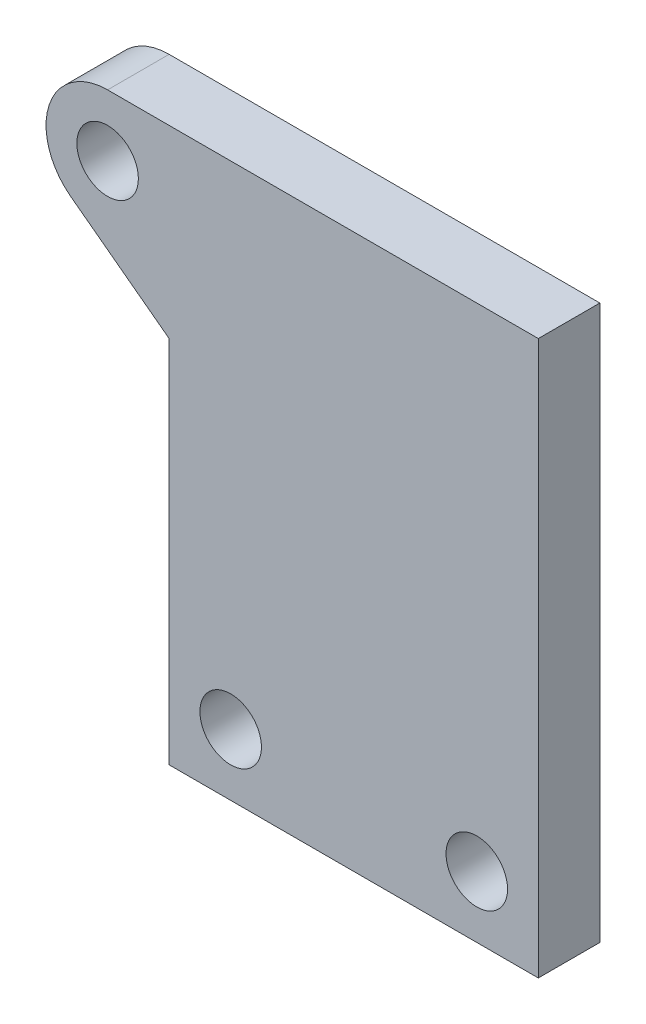
ISO-10303-21;
HEADER;
FILE_DESCRIPTION(('STEP AP214'),'2;1');
FILE_NAME('part.step','',(''),(''),'','','');
FILE_SCHEMA(('AUTOMOTIVE_DESIGN { 1 0 10303 214 1 1 1 1 }'));
ENDSEC;
DATA;
#1=APPLICATION_CONTEXT('core data for automotive mechanical design processes');
#2=APPLICATION_PROTOCOL_DEFINITION('international standard','automotive_design',2000,#1);
#3=PRODUCT_CONTEXT('',#1,'mechanical');
#4=PRODUCT('Part','Part','',(#3));
#5=PRODUCT_RELATED_PRODUCT_CATEGORY('part','',(#4));
#6=PRODUCT_DEFINITION_FORMATION('','',#4);
#7=PRODUCT_DEFINITION_CONTEXT('part definition',#1,'design');
#8=PRODUCT_DEFINITION('design','',#6,#7);
#9=PRODUCT_DEFINITION_SHAPE('','',#8);
#10=(LENGTH_UNIT() NAMED_UNIT(*) SI_UNIT(.MILLI.,.METRE.));
#11=(NAMED_UNIT(*) PLANE_ANGLE_UNIT() SI_UNIT($,.RADIAN.));
#12=(NAMED_UNIT(*) SI_UNIT($,.STERADIAN.) SOLID_ANGLE_UNIT());
#13=UNCERTAINTY_MEASURE_WITH_UNIT(LENGTH_MEASURE(1.E-05),#10,'distance_accuracy_value','');
#14=(GEOMETRIC_REPRESENTATION_CONTEXT(3) GLOBAL_UNCERTAINTY_ASSIGNED_CONTEXT((#13)) GLOBAL_UNIT_ASSIGNED_CONTEXT((#10,
#11,#12)) REPRESENTATION_CONTEXT('',''));
#15=CARTESIAN_POINT('',(0.,0.,0.));
#16=DIRECTION('',(0.,0.,1.));
#17=DIRECTION('',(1.,0.,0.));
#18=AXIS2_PLACEMENT_3D('',#15,#16,#17);
#19=CARTESIAN_POINT('',(-20.,35.,5.));
#20=DIRECTION('',(0.,0.,1.));
#21=DIRECTION('',(1.,0.,0.));
#22=AXIS2_PLACEMENT_3D('',#19,#20,#21);
#23=PLANE('',#22);
#24=CARTESIAN_POINT('',(10.,0.,5.));
#25=DIRECTION('',(0.,0.,1.));
#26=DIRECTION('',(1.,0.,0.));
#27=AXIS2_PLACEMENT_3D('',#24,#25,#26);
#28=CIRCLE('',#27,2.5);
#29=CARTESIAN_POINT('',(12.5,0.,5.));
#30=VERTEX_POINT('',#29);
#31=EDGE_CURVE('E192',#30,#30,#28,.T.);
#32=ORIENTED_EDGE('',*,*,#31,.F.);
#33=EDGE_LOOP('',(#32));
#34=FACE_BOUND('',#33,.T.);
#35=DIRECTION('',(0.,-1.,0.));
#36=VECTOR('',#35,1.);
#37=CARTESIAN_POINT('',(-15.,-5.,5.));
#38=LINE('',#37,#36);
#39=CARTESIAN_POINT('',(-15.,25.,5.));
#40=VERTEX_POINT('',#39);
#41=CARTESIAN_POINT('',(-15.,-5.,5.));
#42=VERTEX_POINT('',#41);
#43=EDGE_CURVE('E137',#40,#42,#38,.T.);
#44=ORIENTED_EDGE('',*,*,#43,.T.);
#45=DIRECTION('',(1.,0.,0.));
#46=VECTOR('',#45,1.);
#47=CARTESIAN_POINT('',(-15.,-5.,5.));
#48=LINE('',#47,#46);
#49=CARTESIAN_POINT('',(15.,-5.,5.));
#50=VERTEX_POINT('',#49);
#51=EDGE_CURVE('E94',#42,#50,#48,.T.);
#52=ORIENTED_EDGE('',*,*,#51,.T.);
#53=DIRECTION('',(0.,1.,0.));
#54=VECTOR('',#53,1.);
#55=CARTESIAN_POINT('',(15.,-5.,5.));
#56=LINE('',#55,#54);
#57=CARTESIAN_POINT('',(15.,40.,5.));
#58=VERTEX_POINT('',#57);
#59=EDGE_CURVE('E107',#50,#58,#56,.T.);
#60=ORIENTED_EDGE('',*,*,#59,.T.);
#61=DIRECTION('',(-1.,0.,0.));
#62=VECTOR('',#61,1.);
#63=CARTESIAN_POINT('',(-20.,40.,5.));
#64=LINE('',#63,#62);
#65=CARTESIAN_POINT('',(-20.,40.,5.));
#66=VERTEX_POINT('',#65);
#67=EDGE_CURVE('E101',#58,#66,#64,.T.);
#68=ORIENTED_EDGE('',*,*,#67,.T.);
#69=CARTESIAN_POINT('',(-20.,35.,5.));
#70=DIRECTION('',(0.,0.,1.));
#71=DIRECTION('',(-1.,0.,0.));
#72=AXIS2_PLACEMENT_3D('',#69,#70,#71);
#73=CIRCLE('',#72,5.);
#74=CARTESIAN_POINT('',(-23.,31.,5.));
#75=VERTEX_POINT('',#74);
#76=EDGE_CURVE('E105',#66,#75,#73,.T.);
#77=ORIENTED_EDGE('',*,*,#76,.T.);
#78=DIRECTION('',(0.8,-0.6,0.));
#79=VECTOR('',#78,1.);
#80=CARTESIAN_POINT('',(-15.,25.,5.));
#81=LINE('',#80,#79);
#82=EDGE_CURVE('E58',#75,#40,#81,.T.);
#83=ORIENTED_EDGE('',*,*,#82,.T.);
#84=EDGE_LOOP('',(#44,#52,#60,#68,#77,#83));
#85=FACE_BOUND('',#84,.T.);
#86=CARTESIAN_POINT('',(-10.,0.,5.));
#87=DIRECTION('',(0.,0.,1.));
#88=DIRECTION('',(1.,0.,0.));
#89=AXIS2_PLACEMENT_3D('',#86,#87,#88);
#90=CIRCLE('',#89,2.5);
#91=CARTESIAN_POINT('',(-7.5,0.,5.));
#92=VERTEX_POINT('',#91);
#93=EDGE_CURVE('E130',#92,#92,#90,.T.);
#94=ORIENTED_EDGE('',*,*,#93,.F.);
#95=EDGE_LOOP('',(#94));
#96=FACE_BOUND('',#95,.T.);
#97=CARTESIAN_POINT('',(-20.,35.,5.));
#98=DIRECTION('',(0.,0.,1.));
#99=DIRECTION('',(1.,0.,0.));
#100=AXIS2_PLACEMENT_3D('',#97,#98,#99);
#101=CIRCLE('',#100,2.5);
#102=CARTESIAN_POINT('',(-17.5,35.,5.));
#103=VERTEX_POINT('',#102);
#104=EDGE_CURVE('E183',#103,#103,#101,.T.);
#105=ORIENTED_EDGE('',*,*,#104,.F.);
#106=EDGE_LOOP('',(#105));
#107=FACE_BOUND('',#106,.T.);
#108=ADVANCED_FACE('F41',(#34,#85,#96,#107),#23,.T.);
#109=CARTESIAN_POINT('',(-20.,35.,0.));
#110=DIRECTION('',(0.,0.,1.));
#111=DIRECTION('',(1.,0.,0.));
#112=AXIS2_PLACEMENT_3D('',#109,#110,#111);
#113=PLANE('',#112);
#114=DIRECTION('',(0.,-1.,0.));
#115=VECTOR('',#114,1.);
#116=CARTESIAN_POINT('',(-15.,-5.,0.));
#117=LINE('',#116,#115);
#118=CARTESIAN_POINT('',(-15.,25.,0.));
#119=VERTEX_POINT('',#118);
#120=CARTESIAN_POINT('',(-15.,-5.,0.));
#121=VERTEX_POINT('',#120);
#122=EDGE_CURVE('E126',#119,#121,#117,.T.);
#123=ORIENTED_EDGE('',*,*,#122,.F.);
#124=DIRECTION('',(0.8,-0.6,0.));
#125=VECTOR('',#124,1.);
#126=CARTESIAN_POINT('',(-15.,25.,0.));
#127=LINE('',#126,#125);
#128=CARTESIAN_POINT('',(-23.,31.,0.));
#129=VERTEX_POINT('',#128);
#130=EDGE_CURVE('E86',#129,#119,#127,.T.);
#131=ORIENTED_EDGE('',*,*,#130,.F.);
#132=CARTESIAN_POINT('',(-20.,35.,0.));
#133=DIRECTION('',(0.,0.,1.));
#134=DIRECTION('',(1.,0.,0.));
#135=AXIS2_PLACEMENT_3D('',#132,#133,#134);
#136=CIRCLE('',#135,5.);
#137=CARTESIAN_POINT('',(-20.,40.,0.));
#138=VERTEX_POINT('',#137);
#139=EDGE_CURVE('E80',#138,#129,#136,.T.);
#140=ORIENTED_EDGE('',*,*,#139,.F.);
#141=DIRECTION('',(-1.,0.,0.));
#142=VECTOR('',#141,1.);
#143=CARTESIAN_POINT('',(-20.,40.,0.));
#144=LINE('',#143,#142);
#145=CARTESIAN_POINT('',(15.,40.,0.));
#146=VERTEX_POINT('',#145);
#147=EDGE_CURVE('E116',#146,#138,#144,.T.);
#148=ORIENTED_EDGE('',*,*,#147,.F.);
#149=DIRECTION('',(0.,1.,0.));
#150=VECTOR('',#149,1.);
#151=CARTESIAN_POINT('',(15.,-5.,0.));
#152=LINE('',#151,#150);
#153=CARTESIAN_POINT('',(15.,-5.,0.));
#154=VERTEX_POINT('',#153);
#155=EDGE_CURVE('E132',#154,#146,#152,.T.);
#156=ORIENTED_EDGE('',*,*,#155,.F.);
#157=DIRECTION('',(1.,0.,0.));
#158=VECTOR('',#157,1.);
#159=CARTESIAN_POINT('',(-15.,-5.,0.));
#160=LINE('',#159,#158);
#161=EDGE_CURVE('E129',#121,#154,#160,.T.);
#162=ORIENTED_EDGE('',*,*,#161,.F.);
#163=EDGE_LOOP('',(#123,#131,#140,#148,#156,#162));
#164=FACE_BOUND('',#163,.T.);
#165=CARTESIAN_POINT('',(-10.,0.,0.));
#166=DIRECTION('',(0.,0.,1.));
#167=DIRECTION('',(1.,0.,0.));
#168=AXIS2_PLACEMENT_3D('',#165,#166,#167);
#169=CIRCLE('',#168,2.5);
#170=CARTESIAN_POINT('',(-7.5,0.,0.));
#171=VERTEX_POINT('',#170);
#172=EDGE_CURVE('E195',#171,#171,#169,.T.);
#173=ORIENTED_EDGE('',*,*,#172,.T.);
#174=EDGE_LOOP('',(#173));
#175=FACE_BOUND('',#174,.T.);
#176=CARTESIAN_POINT('',(10.,0.,0.));
#177=DIRECTION('',(0.,0.,1.));
#178=DIRECTION('',(1.,0.,0.));
#179=AXIS2_PLACEMENT_3D('',#176,#177,#178);
#180=CIRCLE('',#179,2.5);
#181=CARTESIAN_POINT('',(12.5,0.,0.));
#182=VERTEX_POINT('',#181);
#183=EDGE_CURVE('E189',#182,#182,#180,.T.);
#184=ORIENTED_EDGE('',*,*,#183,.T.);
#185=EDGE_LOOP('',(#184));
#186=FACE_BOUND('',#185,.T.);
#187=CARTESIAN_POINT('',(-20.,35.,0.));
#188=DIRECTION('',(0.,0.,1.));
#189=DIRECTION('',(1.,0.,0.));
#190=AXIS2_PLACEMENT_3D('',#187,#188,#189);
#191=CIRCLE('',#190,2.5);
#192=CARTESIAN_POINT('',(-17.5,35.,0.));
#193=VERTEX_POINT('',#192);
#194=EDGE_CURVE('E186',#193,#193,#191,.T.);
#195=ORIENTED_EDGE('',*,*,#194,.T.);
#196=EDGE_LOOP('',(#195));
#197=FACE_BOUND('',#196,.T.);
#198=ADVANCED_FACE('F146',(#164,#175,#186,#197),#113,.F.);
#199=CARTESIAN_POINT('',(-15.,-5.,5.));
#200=DIRECTION('',(1.,0.,0.));
#201=DIRECTION('',(0.,0.,-1.));
#202=AXIS2_PLACEMENT_3D('',#199,#200,#201);
#203=PLANE('',#202);
#204=ORIENTED_EDGE('',*,*,#122,.T.);
#205=DIRECTION('',(0.,0.,-1.));
#206=VECTOR('',#205,1.);
#207=CARTESIAN_POINT('',(-15.,-5.,5.));
#208=LINE('',#207,#206);
#209=EDGE_CURVE('E11',#42,#121,#208,.T.);
#210=ORIENTED_EDGE('',*,*,#209,.F.);
#211=ORIENTED_EDGE('',*,*,#43,.F.);
#212=DIRECTION('',(0.,0.,-1.));
#213=VECTOR('',#212,1.);
#214=CARTESIAN_POINT('',(-15.,25.,5.));
#215=LINE('',#214,#213);
#216=EDGE_CURVE('E122',#40,#119,#215,.T.);
#217=ORIENTED_EDGE('',*,*,#216,.T.);
#218=EDGE_LOOP('',(#204,#210,#211,#217));
#219=FACE_BOUND('',#218,.T.);
#220=ADVANCED_FACE('F43',(#219),#203,.F.);
#221=CARTESIAN_POINT('',(-15.,-5.,5.));
#222=DIRECTION('',(0.,1.,0.));
#223=DIRECTION('',(0.,0.,1.));
#224=AXIS2_PLACEMENT_3D('',#221,#222,#223);
#225=PLANE('',#224);
#226=ORIENTED_EDGE('',*,*,#161,.T.);
#227=DIRECTION('',(0.,0.,-1.));
#228=VECTOR('',#227,1.);
#229=CARTESIAN_POINT('',(15.,-5.,5.));
#230=LINE('',#229,#228);
#231=EDGE_CURVE('E50',#50,#154,#230,.T.);
#232=ORIENTED_EDGE('',*,*,#231,.F.);
#233=ORIENTED_EDGE('',*,*,#51,.F.);
#234=ORIENTED_EDGE('',*,*,#209,.T.);
#235=EDGE_LOOP('',(#226,#232,#233,#234));
#236=FACE_BOUND('',#235,.T.);
#237=ADVANCED_FACE('F247',(#236),#225,.F.);
#238=CARTESIAN_POINT('',(15.,-5.,5.));
#239=DIRECTION('',(-1.,0.,0.));
#240=DIRECTION('',(0.,-1.,0.));
#241=AXIS2_PLACEMENT_3D('',#238,#239,#240);
#242=PLANE('',#241);
#243=ORIENTED_EDGE('',*,*,#155,.T.);
#244=DIRECTION('',(0.,0.,-1.));
#245=VECTOR('',#244,1.);
#246=CARTESIAN_POINT('',(15.,40.,5.));
#247=LINE('',#246,#245);
#248=EDGE_CURVE('E117',#58,#146,#247,.T.);
#249=ORIENTED_EDGE('',*,*,#248,.F.);
#250=ORIENTED_EDGE('',*,*,#59,.F.);
#251=ORIENTED_EDGE('',*,*,#231,.T.);
#252=EDGE_LOOP('',(#243,#249,#250,#251));
#253=FACE_BOUND('',#252,.T.);
#254=ADVANCED_FACE('F143',(#253),#242,.F.);
#255=CARTESIAN_POINT('',(-20.,40.,5.));
#256=DIRECTION('',(0.,-1.,0.));
#257=DIRECTION('',(0.,0.,-1.));
#258=AXIS2_PLACEMENT_3D('',#255,#256,#257);
#259=PLANE('',#258);
#260=ORIENTED_EDGE('',*,*,#147,.T.);
#261=DIRECTION('',(0.,0.,-1.));
#262=VECTOR('',#261,1.);
#263=CARTESIAN_POINT('',(-20.,40.,5.));
#264=LINE('',#263,#262);
#265=EDGE_CURVE('E113',#66,#138,#264,.T.);
#266=ORIENTED_EDGE('',*,*,#265,.F.);
#267=ORIENTED_EDGE('',*,*,#67,.F.);
#268=ORIENTED_EDGE('',*,*,#248,.T.);
#269=EDGE_LOOP('',(#260,#266,#267,#268));
#270=FACE_BOUND('',#269,.T.);
#271=ADVANCED_FACE('F114',(#270),#259,.F.);
#272=CARTESIAN_POINT('',(-20.,35.,5.));
#273=DIRECTION('',(0.,0.,-1.));
#274=DIRECTION('',(-1.,0.,0.));
#275=AXIS2_PLACEMENT_3D('',#272,#273,#274);
#276=CYLINDRICAL_SURFACE('',#275,5.);
#277=ORIENTED_EDGE('',*,*,#139,.T.);
#278=DIRECTION('',(0.,0.,-1.));
#279=VECTOR('',#278,1.);
#280=CARTESIAN_POINT('',(-23.,31.,5.));
#281=LINE('',#280,#279);
#282=EDGE_CURVE('E118',#75,#129,#281,.T.);
#283=ORIENTED_EDGE('',*,*,#282,.F.);
#284=ORIENTED_EDGE('',*,*,#76,.F.);
#285=ORIENTED_EDGE('',*,*,#265,.T.);
#286=EDGE_LOOP('',(#277,#283,#284,#285));
#287=FACE_BOUND('',#286,.T.);
#288=ADVANCED_FACE('F120',(#287),#276,.T.);
#289=CARTESIAN_POINT('',(-15.,25.,5.));
#290=DIRECTION('',(0.6,0.8,0.));
#291=DIRECTION('',(-0.8,0.6,0.));
#292=AXIS2_PLACEMENT_3D('',#289,#290,#291);
#293=PLANE('',#292);
#294=ORIENTED_EDGE('',*,*,#130,.T.);
#295=ORIENTED_EDGE('',*,*,#216,.F.);
#296=ORIENTED_EDGE('',*,*,#82,.F.);
#297=ORIENTED_EDGE('',*,*,#282,.T.);
#298=EDGE_LOOP('',(#294,#295,#296,#297));
#299=FACE_BOUND('',#298,.T.);
#300=ADVANCED_FACE('F151',(#299),#293,.F.);
#301=CARTESIAN_POINT('',(-10.,0.,5.));
#302=DIRECTION('',(0.,0.,-1.));
#303=DIRECTION('',(-1.,0.,0.));
#304=AXIS2_PLACEMENT_3D('',#301,#302,#303);
#305=CYLINDRICAL_SURFACE('',#304,2.5);
#306=ORIENTED_EDGE('',*,*,#93,.T.);
#307=EDGE_LOOP('',(#306));
#308=FACE_BOUND('',#307,.T.);
#309=ORIENTED_EDGE('',*,*,#172,.F.);
#310=EDGE_LOOP('',(#309));
#311=FACE_BOUND('',#310,.T.);
#312=ADVANCED_FACE('F153',(#308,#311),#305,.F.);
#313=CARTESIAN_POINT('',(10.,0.,5.));
#314=DIRECTION('',(0.,0.,-1.));
#315=DIRECTION('',(-1.,0.,0.));
#316=AXIS2_PLACEMENT_3D('',#313,#314,#315);
#317=CYLINDRICAL_SURFACE('',#316,2.5);
#318=ORIENTED_EDGE('',*,*,#31,.T.);
#319=EDGE_LOOP('',(#318));
#320=FACE_BOUND('',#319,.T.);
#321=ORIENTED_EDGE('',*,*,#183,.F.);
#322=EDGE_LOOP('',(#321));
#323=FACE_BOUND('',#322,.T.);
#324=ADVANCED_FACE('F159',(#320,#323),#317,.F.);
#325=CARTESIAN_POINT('',(-20.,35.,5.));
#326=DIRECTION('',(0.,0.,-1.));
#327=DIRECTION('',(-1.,0.,0.));
#328=AXIS2_PLACEMENT_3D('',#325,#326,#327);
#329=CYLINDRICAL_SURFACE('',#328,2.5);
#330=ORIENTED_EDGE('',*,*,#104,.T.);
#331=EDGE_LOOP('',(#330));
#332=FACE_BOUND('',#331,.T.);
#333=ORIENTED_EDGE('',*,*,#194,.F.);
#334=EDGE_LOOP('',(#333));
#335=FACE_BOUND('',#334,.T.);
#336=ADVANCED_FACE('F174',(#332,#335),#329,.F.);
#337=CLOSED_SHELL('',(#108,#198,#220,#237,#254,#271,#288,#300,#312,#324,#336));
#338=MANIFOLD_SOLID_BREP('B2',#337);
#339=ADVANCED_BREP_SHAPE_REPRESENTATION('',(#18,#338),#14);
#340=SHAPE_DEFINITION_REPRESENTATION(#9,#339);
ENDSEC;
END-ISO-10303-21;
